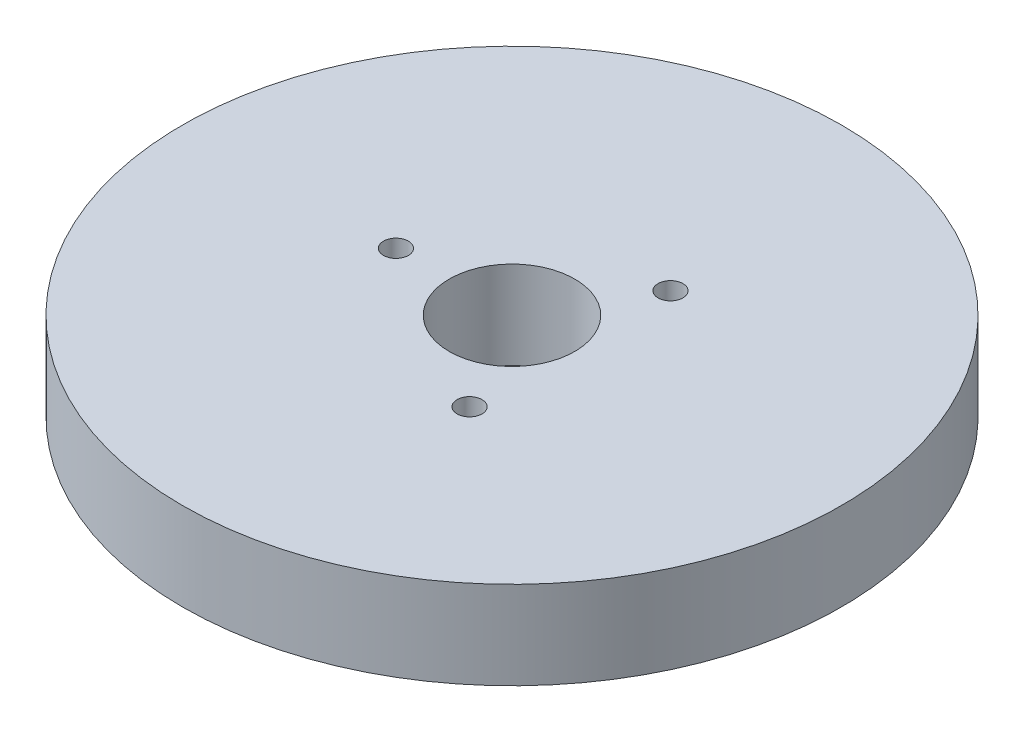
ISO-10303-21;
HEADER;
FILE_DESCRIPTION(('STEP AP214'),'2;1');
FILE_NAME('part.step','',(''),(''),'','','');
FILE_SCHEMA(('AUTOMOTIVE_DESIGN { 1 0 10303 214 1 1 1 1 }'));
ENDSEC;
DATA;
#1=APPLICATION_CONTEXT('core data for automotive mechanical design processes');
#2=APPLICATION_PROTOCOL_DEFINITION('international standard','automotive_design',2000,#1);
#3=PRODUCT_CONTEXT('',#1,'mechanical');
#4=PRODUCT('Part','Part','',(#3));
#5=PRODUCT_RELATED_PRODUCT_CATEGORY('part','',(#4));
#6=PRODUCT_DEFINITION_FORMATION('','',#4);
#7=PRODUCT_DEFINITION_CONTEXT('part definition',#1,'design');
#8=PRODUCT_DEFINITION('design','',#6,#7);
#9=PRODUCT_DEFINITION_SHAPE('','',#8);
#10=(LENGTH_UNIT() NAMED_UNIT(*) SI_UNIT(.MILLI.,.METRE.));
#11=(NAMED_UNIT(*) PLANE_ANGLE_UNIT() SI_UNIT($,.RADIAN.));
#12=(NAMED_UNIT(*) SI_UNIT($,.STERADIAN.) SOLID_ANGLE_UNIT());
#13=UNCERTAINTY_MEASURE_WITH_UNIT(LENGTH_MEASURE(1.E-05),#10,'distance_accuracy_value','');
#14=(GEOMETRIC_REPRESENTATION_CONTEXT(3) GLOBAL_UNCERTAINTY_ASSIGNED_CONTEXT((#13)) GLOBAL_UNIT_ASSIGNED_CONTEXT((#10,
#11,#12)) REPRESENTATION_CONTEXT('',''));
#15=CARTESIAN_POINT('',(0.,0.,0.));
#16=DIRECTION('',(0.,0.,1.));
#17=DIRECTION('',(1.,0.,0.));
#18=AXIS2_PLACEMENT_3D('',#15,#16,#17);
#19=CARTESIAN_POINT('',(0.,14.,0.));
#20=DIRECTION('',(0.,-1.,0.));
#21=DIRECTION('',(0.,0.,-1.));
#22=AXIS2_PLACEMENT_3D('',#19,#20,#21);
#23=CYLINDRICAL_SURFACE('',#22,52.5);
#24=CARTESIAN_POINT('',(0.,14.,0.));
#25=DIRECTION('',(0.,1.,0.));
#26=DIRECTION('',(0.,0.,1.));
#27=AXIS2_PLACEMENT_3D('',#24,#25,#26);
#28=CIRCLE('',#27,52.5);
#29=CARTESIAN_POINT('',(0.,14.,52.5));
#30=VERTEX_POINT('',#29);
#31=EDGE_CURVE('E10',#30,#30,#28,.T.);
#32=ORIENTED_EDGE('',*,*,#31,.F.);
#33=EDGE_LOOP('',(#32));
#34=FACE_BOUND('',#33,.T.);
#35=CARTESIAN_POINT('',(0.,0.,0.));
#36=DIRECTION('',(0.,1.,0.));
#37=DIRECTION('',(0.,0.,1.));
#38=AXIS2_PLACEMENT_3D('',#35,#36,#37);
#39=CIRCLE('',#38,52.5);
#40=CARTESIAN_POINT('',(0.,0.,52.5));
#41=VERTEX_POINT('',#40);
#42=EDGE_CURVE('E37',#41,#41,#39,.T.);
#43=ORIENTED_EDGE('',*,*,#42,.T.);
#44=EDGE_LOOP('',(#43));
#45=FACE_BOUND('',#44,.T.);
#46=ADVANCED_FACE('F40',(#34,#45),#23,.T.);
#47=CARTESIAN_POINT('',(0.,14.,0.));
#48=DIRECTION('',(0.,1.,0.));
#49=DIRECTION('',(0.,0.,1.));
#50=AXIS2_PLACEMENT_3D('',#47,#48,#49);
#51=PLANE('',#50);
#52=CARTESIAN_POINT('',(9.24154055311574,14.,16.0068177782045));
#53=DIRECTION('',(0.,1.,0.));
#54=DIRECTION('',(0.866025403784436,0.,-0.500000000000004));
#55=AXIS2_PLACEMENT_3D('',#52,#53,#54);
#56=CIRCLE('',#55,1.98211370245601);
#57=CARTESIAN_POINT('',(10.9581013726319,14.,15.0157609269765));
#58=VERTEX_POINT('',#57);
#59=EDGE_CURVE('E70',#58,#58,#56,.T.);
#60=ORIENTED_EDGE('',*,*,#59,.F.);
#61=EDGE_LOOP('',(#60));
#62=FACE_BOUND('',#61,.T.);
#63=CARTESIAN_POINT('',(9.24154055311551,14.,-16.0068177782046));
#64=DIRECTION('',(0.,1.,0.));
#65=DIRECTION('',(-0.866025403784443,0.,-0.499999999999992));
#66=AXIS2_PLACEMENT_3D('',#63,#64,#65);
#67=CIRCLE('',#66,1.98211370245601);
#68=CARTESIAN_POINT('',(7.52497973359937,14.,-16.9978746294326));
#69=VERTEX_POINT('',#68);
#70=EDGE_CURVE('E61',#69,#69,#67,.T.);
#71=ORIENTED_EDGE('',*,*,#70,.F.);
#72=EDGE_LOOP('',(#71));
#73=FACE_BOUND('',#72,.T.);
#74=CARTESIAN_POINT('',(-18.4830811062313,14.,0.));
#75=DIRECTION('',(0.,1.,0.));
#76=DIRECTION('',(0.,0.,1.));
#77=AXIS2_PLACEMENT_3D('',#74,#75,#76);
#78=CIRCLE('',#77,1.98211370245601);
#79=CARTESIAN_POINT('',(-18.4830811062313,14.,1.98211370245601));
#80=VERTEX_POINT('',#79);
#81=EDGE_CURVE('E54',#80,#80,#78,.T.);
#82=ORIENTED_EDGE('',*,*,#81,.F.);
#83=EDGE_LOOP('',(#82));
#84=FACE_BOUND('',#83,.T.);
#85=CARTESIAN_POINT('',(0.,14.,0.));
#86=DIRECTION('',(0.,1.,0.));
#87=DIRECTION('',(0.,0.,1.));
#88=AXIS2_PLACEMENT_3D('',#85,#86,#87);
#89=CIRCLE('',#88,10.);
#90=CARTESIAN_POINT('',(0.,14.,10.));
#91=VERTEX_POINT('',#90);
#92=EDGE_CURVE('E50',#91,#91,#89,.T.);
#93=ORIENTED_EDGE('',*,*,#92,.F.);
#94=EDGE_LOOP('',(#93));
#95=FACE_BOUND('',#94,.T.);
#96=ORIENTED_EDGE('',*,*,#31,.T.);
#97=EDGE_LOOP('',(#96));
#98=FACE_BOUND('',#97,.T.);
#99=ADVANCED_FACE('F85',(#62,#73,#84,#95,#98),#51,.T.);
#100=CARTESIAN_POINT('',(0.,0.,0.));
#101=DIRECTION('',(0.,1.,0.));
#102=DIRECTION('',(0.,0.,1.));
#103=AXIS2_PLACEMENT_3D('',#100,#101,#102);
#104=PLANE('',#103);
#105=CARTESIAN_POINT('',(0.,0.,0.));
#106=DIRECTION('',(0.,1.,0.));
#107=DIRECTION('',(0.,0.,1.));
#108=AXIS2_PLACEMENT_3D('',#105,#106,#107);
#109=CIRCLE('',#108,10.);
#110=CARTESIAN_POINT('',(0.,0.,10.));
#111=VERTEX_POINT('',#110);
#112=EDGE_CURVE('E47',#111,#111,#109,.T.);
#113=ORIENTED_EDGE('',*,*,#112,.T.);
#114=EDGE_LOOP('',(#113));
#115=FACE_BOUND('',#114,.T.);
#116=ORIENTED_EDGE('',*,*,#42,.F.);
#117=EDGE_LOOP('',(#116));
#118=FACE_BOUND('',#117,.T.);
#119=ADVANCED_FACE('F84',(#115,#118),#104,.F.);
#120=CARTESIAN_POINT('',(0.,14.,0.));
#121=DIRECTION('',(0.,-1.,0.));
#122=DIRECTION('',(0.,0.,-1.));
#123=AXIS2_PLACEMENT_3D('',#120,#121,#122);
#124=CYLINDRICAL_SURFACE('',#123,10.);
#125=ORIENTED_EDGE('',*,*,#92,.T.);
#126=EDGE_LOOP('',(#125));
#127=FACE_BOUND('',#126,.T.);
#128=ORIENTED_EDGE('',*,*,#112,.F.);
#129=EDGE_LOOP('',(#128));
#130=FACE_BOUND('',#129,.T.);
#131=ADVANCED_FACE('F91',(#127,#130),#124,.F.);
#132=CARTESIAN_POINT('',(-18.4830811062313,0.430306648426922,0.));
#133=DIRECTION('',(0.,1.,0.));
#134=DIRECTION('',(0.,0.,1.));
#135=AXIS2_PLACEMENT_3D('',#132,#133,#134);
#136=CYLINDRICAL_SURFACE('',#135,1.98211370245601);
#137=CARTESIAN_POINT('',(-18.4830811062313,0.430306648426922,0.));
#138=DIRECTION('',(0.,1.,0.));
#139=DIRECTION('',(0.,0.,1.));
#140=AXIS2_PLACEMENT_3D('',#137,#138,#139);
#141=CIRCLE('',#140,1.98211370245601);
#142=CARTESIAN_POINT('',(-18.4830811062313,0.430306648426922,1.98211370245601));
#143=VERTEX_POINT('',#142);
#144=EDGE_CURVE('E55',#143,#143,#141,.T.);
#145=ORIENTED_EDGE('',*,*,#144,.F.);
#146=EDGE_LOOP('',(#145));
#147=FACE_BOUND('',#146,.T.);
#148=ORIENTED_EDGE('',*,*,#81,.T.);
#149=EDGE_LOOP('',(#148));
#150=FACE_BOUND('',#149,.T.);
#151=ADVANCED_FACE('F96',(#147,#150),#136,.F.);
#152=CARTESIAN_POINT('',(-18.4830811062313,0.430306648426922,0.));
#153=DIRECTION('',(0.,1.,0.));
#154=DIRECTION('',(0.,0.,1.));
#155=AXIS2_PLACEMENT_3D('',#152,#153,#154);
#156=PLANE('',#155);
#157=ORIENTED_EDGE('',*,*,#144,.T.);
#158=EDGE_LOOP('',(#157));
#159=FACE_BOUND('',#158,.T.);
#160=ADVANCED_FACE('F127',(#159),#156,.T.);
#161=CARTESIAN_POINT('',(9.24154055311551,0.430306648426922,-16.0068177782046));
#162=DIRECTION('',(0.,1.,0.));
#163=DIRECTION('',(0.,0.,1.));
#164=AXIS2_PLACEMENT_3D('',#161,#162,#163);
#165=CYLINDRICAL_SURFACE('',#164,1.98211370245601);
#166=CARTESIAN_POINT('',(9.24154055311551,0.430306648426922,-16.0068177782046));
#167=DIRECTION('',(0.,1.,0.));
#168=DIRECTION('',(-0.866025403784443,0.,-0.499999999999992));
#169=AXIS2_PLACEMENT_3D('',#166,#167,#168);
#170=CIRCLE('',#169,1.98211370245601);
#171=CARTESIAN_POINT('',(7.52497973359937,0.430306648426922,-16.9978746294326));
#172=VERTEX_POINT('',#171);
#173=EDGE_CURVE('E63',#172,#172,#170,.T.);
#174=ORIENTED_EDGE('',*,*,#173,.F.);
#175=EDGE_LOOP('',(#174));
#176=FACE_BOUND('',#175,.T.);
#177=ORIENTED_EDGE('',*,*,#70,.T.);
#178=EDGE_LOOP('',(#177));
#179=FACE_BOUND('',#178,.T.);
#180=ADVANCED_FACE('F133',(#176,#179),#165,.F.);
#181=CARTESIAN_POINT('',(9.24154055311551,0.430306648426922,-16.0068177782046));
#182=DIRECTION('',(0.,1.,0.));
#183=DIRECTION('',(-0.866025403784443,0.,-0.499999999999992));
#184=AXIS2_PLACEMENT_3D('',#181,#182,#183);
#185=PLANE('',#184);
#186=ORIENTED_EDGE('',*,*,#173,.T.);
#187=EDGE_LOOP('',(#186));
#188=FACE_BOUND('',#187,.T.);
#189=ADVANCED_FACE('F77',(#188),#185,.T.);
#190=CARTESIAN_POINT('',(9.24154055311574,0.430306648426922,16.0068177782045));
#191=DIRECTION('',(0.,1.,0.));
#192=DIRECTION('',(0.,0.,1.));
#193=AXIS2_PLACEMENT_3D('',#190,#191,#192);
#194=CYLINDRICAL_SURFACE('',#193,1.98211370245601);
#195=CARTESIAN_POINT('',(9.24154055311574,0.430306648426922,16.0068177782045));
#196=DIRECTION('',(0.,1.,0.));
#197=DIRECTION('',(0.866025403784436,0.,-0.500000000000004));
#198=AXIS2_PLACEMENT_3D('',#195,#196,#197);
#199=CIRCLE('',#198,1.98211370245601);
#200=CARTESIAN_POINT('',(10.9581013726319,0.430306648426922,15.0157609269765));
#201=VERTEX_POINT('',#200);
#202=EDGE_CURVE('E59',#201,#201,#199,.T.);
#203=ORIENTED_EDGE('',*,*,#202,.F.);
#204=EDGE_LOOP('',(#203));
#205=FACE_BOUND('',#204,.T.);
#206=ORIENTED_EDGE('',*,*,#59,.T.);
#207=EDGE_LOOP('',(#206));
#208=FACE_BOUND('',#207,.T.);
#209=ADVANCED_FACE('F73',(#205,#208),#194,.F.);
#210=CARTESIAN_POINT('',(9.24154055311574,0.430306648426922,16.0068177782045));
#211=DIRECTION('',(0.,1.,0.));
#212=DIRECTION('',(0.866025403784436,0.,-0.500000000000004));
#213=AXIS2_PLACEMENT_3D('',#210,#211,#212);
#214=PLANE('',#213);
#215=ORIENTED_EDGE('',*,*,#202,.T.);
#216=EDGE_LOOP('',(#215));
#217=FACE_BOUND('',#216,.T.);
#218=ADVANCED_FACE('F71',(#217),#214,.T.);
#219=CLOSED_SHELL('',(#46,#99,#119,#131,#151,#160,#180,#189,#209,#218));
#220=MANIFOLD_SOLID_BREP('B2',#219);
#221=ADVANCED_BREP_SHAPE_REPRESENTATION('',(#18,#220),#14);
#222=SHAPE_DEFINITION_REPRESENTATION(#9,#221);
ENDSEC;
END-ISO-10303-21;
